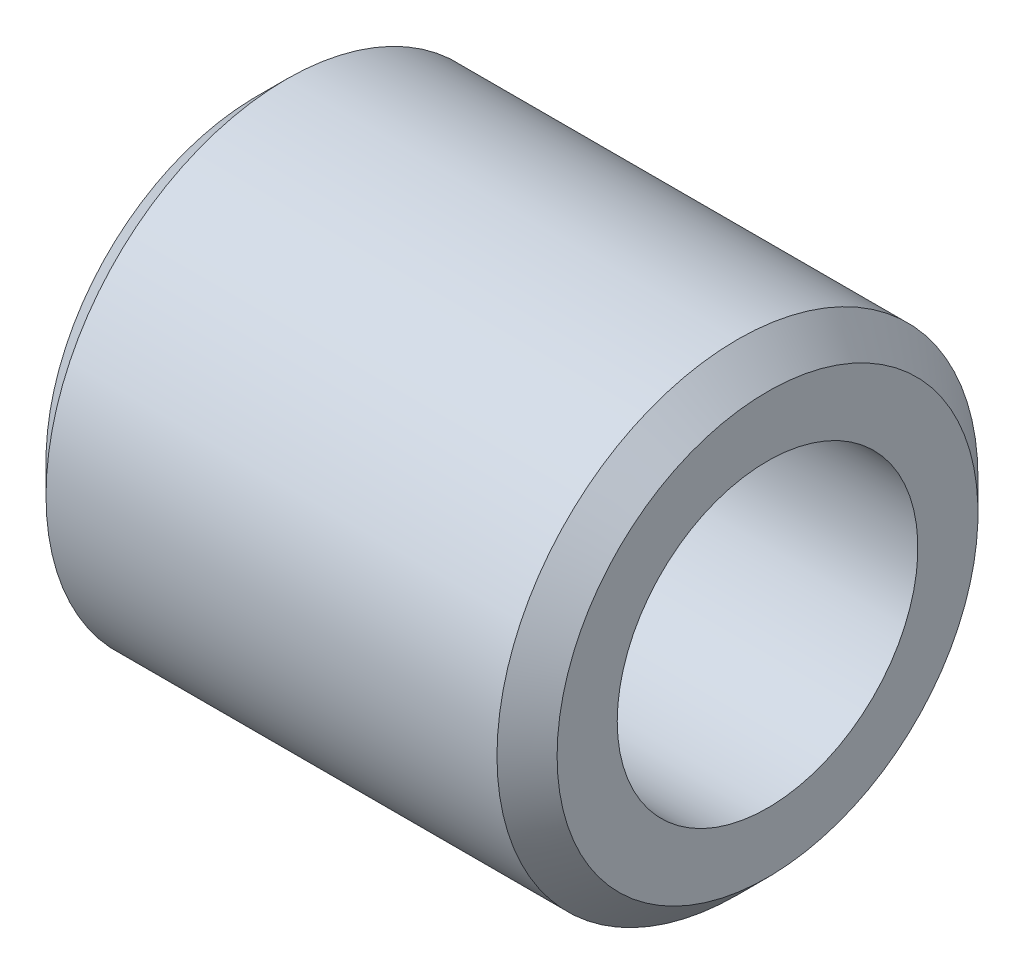
ISO-10303-21;
HEADER;
FILE_DESCRIPTION(('STEP AP214'),'2;1');
FILE_NAME('part.step','',(''),(''),'','','');
FILE_SCHEMA(('AUTOMOTIVE_DESIGN { 1 0 10303 214 1 1 1 1 }'));
ENDSEC;
DATA;
#1=APPLICATION_CONTEXT('core data for automotive mechanical design processes');
#2=APPLICATION_PROTOCOL_DEFINITION('international standard','automotive_design',2000,#1);
#3=PRODUCT_CONTEXT('',#1,'mechanical');
#4=PRODUCT('Part','Part','',(#3));
#5=PRODUCT_RELATED_PRODUCT_CATEGORY('part','',(#4));
#6=PRODUCT_DEFINITION_FORMATION('','',#4);
#7=PRODUCT_DEFINITION_CONTEXT('part definition',#1,'design');
#8=PRODUCT_DEFINITION('design','',#6,#7);
#9=PRODUCT_DEFINITION_SHAPE('','',#8);
#10=(LENGTH_UNIT() NAMED_UNIT(*) SI_UNIT(.MILLI.,.METRE.));
#11=(NAMED_UNIT(*) PLANE_ANGLE_UNIT() SI_UNIT($,.RADIAN.));
#12=(NAMED_UNIT(*) SI_UNIT($,.STERADIAN.) SOLID_ANGLE_UNIT());
#13=UNCERTAINTY_MEASURE_WITH_UNIT(LENGTH_MEASURE(1.E-05),#10,'distance_accuracy_value','');
#14=(GEOMETRIC_REPRESENTATION_CONTEXT(3) GLOBAL_UNCERTAINTY_ASSIGNED_CONTEXT((#13)) GLOBAL_UNIT_ASSIGNED_CONTEXT((#10,
#11,#12)) REPRESENTATION_CONTEXT('',''));
#15=CARTESIAN_POINT('',(0.,0.,0.));
#16=DIRECTION('',(0.,0.,1.));
#17=DIRECTION('',(1.,0.,0.));
#18=AXIS2_PLACEMENT_3D('',#15,#16,#17);
#19=CARTESIAN_POINT('',(4.25,0.,0.));
#20=DIRECTION('',(-1.,0.,0.));
#21=DIRECTION('',(0.,0.,1.));
#22=AXIS2_PLACEMENT_3D('',#19,#20,#21);
#23=CYLINDRICAL_SURFACE('',#22,2.5);
#24=CARTESIAN_POINT('',(-4.25,0.,0.));
#25=DIRECTION('',(-1.,0.,0.));
#26=DIRECTION('',(0.,0.,1.));
#27=AXIS2_PLACEMENT_3D('',#24,#25,#26);
#28=CIRCLE('',#27,2.5);
#29=CARTESIAN_POINT('',(-4.25,0.,2.5));
#30=VERTEX_POINT('',#29);
#31=EDGE_CURVE('E33',#30,#30,#28,.T.);
#32=ORIENTED_EDGE('',*,*,#31,.T.);
#33=EDGE_LOOP('',(#32));
#34=FACE_BOUND('',#33,.T.);
#35=CARTESIAN_POINT('',(4.25,0.,0.));
#36=DIRECTION('',(-1.,0.,0.));
#37=DIRECTION('',(0.,0.,1.));
#38=AXIS2_PLACEMENT_3D('',#35,#36,#37);
#39=CIRCLE('',#38,2.5);
#40=CARTESIAN_POINT('',(4.25,0.,2.5));
#41=VERTEX_POINT('',#40);
#42=EDGE_CURVE('E17',#41,#41,#39,.T.);
#43=ORIENTED_EDGE('',*,*,#42,.F.);
#44=EDGE_LOOP('',(#43));
#45=FACE_BOUND('',#44,.T.);
#46=ADVANCED_FACE('F14',(#34,#45),#23,.F.);
#47=CARTESIAN_POINT('',(4.25,0.,0.));
#48=DIRECTION('',(1.,0.,0.));
#49=DIRECTION('',(0.,0.,-1.));
#50=AXIS2_PLACEMENT_3D('',#47,#48,#49);
#51=PLANE('',#50);
#52=ORIENTED_EDGE('',*,*,#42,.T.);
#53=EDGE_LOOP('',(#52));
#54=FACE_BOUND('',#53,.T.);
#55=CARTESIAN_POINT('',(4.25000000001319,0.,0.));
#56=DIRECTION('',(-1.,0.,0.));
#57=DIRECTION('',(0.,0.,1.));
#58=AXIS2_PLACEMENT_3D('',#55,#56,#57);
#59=CIRCLE('',#58,3.50000000003092);
#60=CARTESIAN_POINT('',(4.25000000001319,0.,3.50000000003092));
#61=VERTEX_POINT('',#60);
#62=EDGE_CURVE('E31',#61,#61,#59,.T.);
#63=ORIENTED_EDGE('',*,*,#62,.F.);
#64=EDGE_LOOP('',(#63));
#65=FACE_BOUND('',#64,.T.);
#66=ADVANCED_FACE('F40',(#54,#65),#51,.T.);
#67=CARTESIAN_POINT('',(-4.25,0.,0.));
#68=DIRECTION('',(1.,0.,0.));
#69=DIRECTION('',(0.,0.,-1.));
#70=AXIS2_PLACEMENT_3D('',#67,#68,#69);
#71=PLANE('',#70);
#72=ORIENTED_EDGE('',*,*,#31,.F.);
#73=EDGE_LOOP('',(#72));
#74=FACE_BOUND('',#73,.T.);
#75=CARTESIAN_POINT('',(-4.25000000001319,0.,0.));
#76=DIRECTION('',(1.,0.,0.));
#77=DIRECTION('',(0.,0.,-1.));
#78=AXIS2_PLACEMENT_3D('',#75,#76,#77);
#79=CIRCLE('',#78,3.49999999997408);
#80=CARTESIAN_POINT('',(-4.25000000001319,0.,-3.49999999997408));
#81=VERTEX_POINT('',#80);
#82=EDGE_CURVE('E26',#81,#81,#79,.T.);
#83=ORIENTED_EDGE('',*,*,#82,.F.);
#84=EDGE_LOOP('',(#83));
#85=FACE_BOUND('',#84,.T.);
#86=ADVANCED_FACE('F48',(#74,#85),#71,.F.);
#87=CARTESIAN_POINT('',(3.74999999996817,0.,0.));
#88=DIRECTION('',(-1.,0.,0.));
#89=DIRECTION('',(0.,0.,1.));
#90=AXIS2_PLACEMENT_3D('',#87,#88,#89);
#91=CONICAL_SURFACE('',#90,4.0000000000191,0.785398163340605);
#92=CARTESIAN_POINT('',(3.75,0.,0.));
#93=DIRECTION('',(-1.,0.,0.));
#94=DIRECTION('',(0.,0.,1.));
#95=AXIS2_PLACEMENT_3D('',#92,#93,#94);
#96=CIRCLE('',#95,4.);
#97=CARTESIAN_POINT('',(3.75,0.,4.));
#98=VERTEX_POINT('',#97);
#99=EDGE_CURVE('E21',#98,#98,#96,.T.);
#100=ORIENTED_EDGE('',*,*,#99,.F.);
#101=EDGE_LOOP('',(#100));
#102=FACE_BOUND('',#101,.T.);
#103=ORIENTED_EDGE('',*,*,#62,.T.);
#104=EDGE_LOOP('',(#103));
#105=FACE_BOUND('',#104,.T.);
#106=ADVANCED_FACE('F56',(#102,#105),#91,.T.);
#107=CARTESIAN_POINT('',(-3.74999999991132,0.,0.));
#108=DIRECTION('',(1.,0.,0.));
#109=DIRECTION('',(0.,0.,-1.));
#110=AXIS2_PLACEMENT_3D('',#107,#108,#109);
#111=CONICAL_SURFACE('',#110,4.0000000000191,0.785398163340605);
#112=CARTESIAN_POINT('',(-3.75,0.,0.));
#113=DIRECTION('',(-1.,0.,0.));
#114=DIRECTION('',(0.,0.,1.));
#115=AXIS2_PLACEMENT_3D('',#112,#113,#114);
#116=CIRCLE('',#115,4.);
#117=CARTESIAN_POINT('',(-3.75,0.,4.));
#118=VERTEX_POINT('',#117);
#119=EDGE_CURVE('E10',#118,#118,#116,.F.);
#120=ORIENTED_EDGE('',*,*,#119,.F.);
#121=EDGE_LOOP('',(#120));
#122=FACE_BOUND('',#121,.T.);
#123=ORIENTED_EDGE('',*,*,#82,.T.);
#124=EDGE_LOOP('',(#123));
#125=FACE_BOUND('',#124,.T.);
#126=ADVANCED_FACE('F51',(#122,#125),#111,.T.);
#127=CARTESIAN_POINT('',(4.25,0.,0.));
#128=DIRECTION('',(-1.,0.,0.));
#129=DIRECTION('',(0.,0.,1.));
#130=AXIS2_PLACEMENT_3D('',#127,#128,#129);
#131=CYLINDRICAL_SURFACE('',#130,4.);
#132=ORIENTED_EDGE('',*,*,#119,.T.);
#133=EDGE_LOOP('',(#132));
#134=FACE_BOUND('',#133,.T.);
#135=ORIENTED_EDGE('',*,*,#99,.T.);
#136=EDGE_LOOP('',(#135));
#137=FACE_BOUND('',#136,.T.);
#138=ADVANCED_FACE('F49',(#134,#137),#131,.T.);
#139=CLOSED_SHELL('',(#46,#66,#86,#106,#126,#138));
#140=MANIFOLD_SOLID_BREP('B1',#139);
#141=ADVANCED_BREP_SHAPE_REPRESENTATION('',(#18,#140),#14);
#142=SHAPE_DEFINITION_REPRESENTATION(#9,#141);
ENDSEC;
END-ISO-10303-21;
